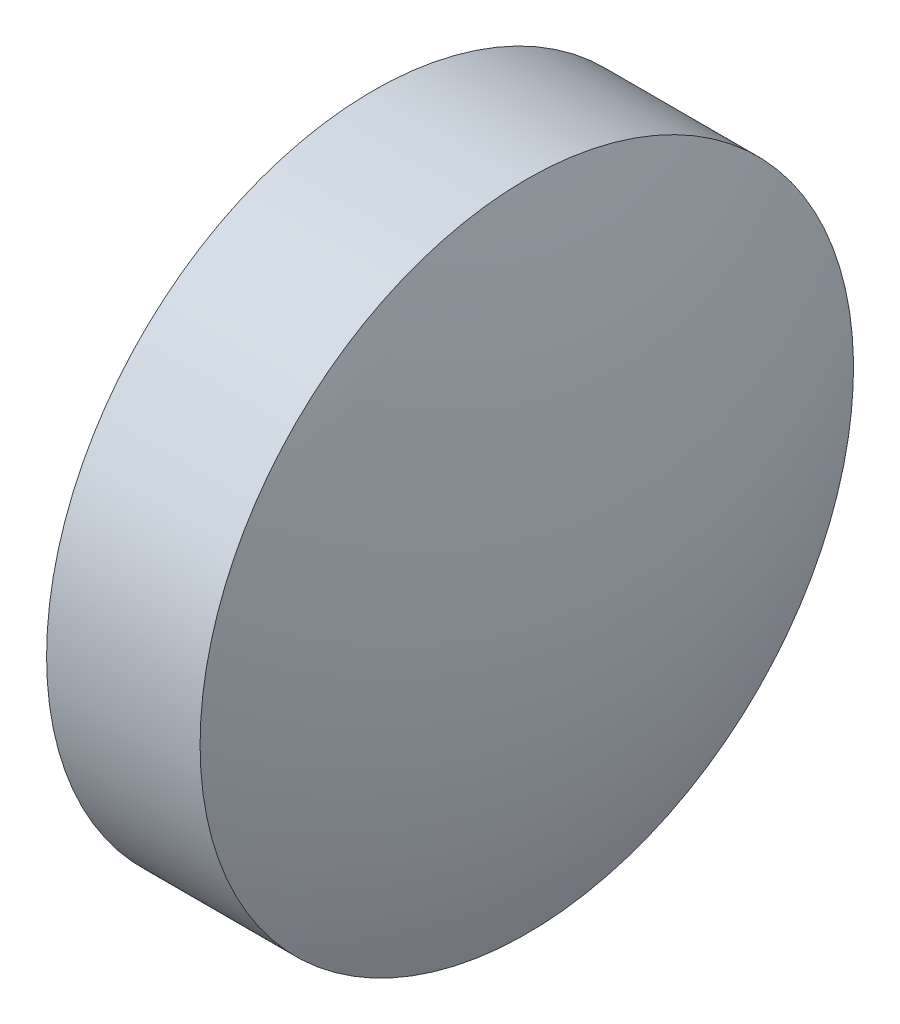
ISO-10303-21;
HEADER;
FILE_DESCRIPTION(('STEP AP214'),'2;1');
FILE_NAME('part.step','',(''),(''),'','','');
FILE_SCHEMA(('AUTOMOTIVE_DESIGN { 1 0 10303 214 1 1 1 1 }'));
ENDSEC;
DATA;
#1=APPLICATION_CONTEXT('core data for automotive mechanical design processes');
#2=APPLICATION_PROTOCOL_DEFINITION('international standard','automotive_design',2000,#1);
#3=PRODUCT_CONTEXT('',#1,'mechanical');
#4=PRODUCT('Part','Part','',(#3));
#5=PRODUCT_RELATED_PRODUCT_CATEGORY('part','',(#4));
#6=PRODUCT_DEFINITION_FORMATION('','',#4);
#7=PRODUCT_DEFINITION_CONTEXT('part definition',#1,'design');
#8=PRODUCT_DEFINITION('design','',#6,#7);
#9=PRODUCT_DEFINITION_SHAPE('','',#8);
#10=(LENGTH_UNIT() NAMED_UNIT(*) SI_UNIT(.MILLI.,.METRE.));
#11=(NAMED_UNIT(*) PLANE_ANGLE_UNIT() SI_UNIT($,.RADIAN.));
#12=(NAMED_UNIT(*) SI_UNIT($,.STERADIAN.) SOLID_ANGLE_UNIT());
#13=UNCERTAINTY_MEASURE_WITH_UNIT(LENGTH_MEASURE(1.E-05),#10,'distance_accuracy_value','');
#14=(GEOMETRIC_REPRESENTATION_CONTEXT(3) GLOBAL_UNCERTAINTY_ASSIGNED_CONTEXT((#13)) GLOBAL_UNIT_ASSIGNED_CONTEXT((#10,
#11,#12)) REPRESENTATION_CONTEXT('',''));
#15=CARTESIAN_POINT('',(0.,0.,0.));
#16=DIRECTION('',(0.,0.,1.));
#17=DIRECTION('',(1.,0.,0.));
#18=AXIS2_PLACEMENT_3D('',#15,#16,#17);
#19=CARTESIAN_POINT('',(508.904259587121,138.924621117667,0.));
#20=DIRECTION('',(-1.,0.,0.));
#21=DIRECTION('',(0.,1.,0.));
#22=AXIS2_PLACEMENT_3D('',#19,#20,#21);
#23=SPHERICAL_SURFACE('',#22,8.31201612903223);
#24=CARTESIAN_POINT('',(516.596275716153,138.924621117667,0.));
#25=DIRECTION('',(-1.,0.,0.));
#26=DIRECTION('',(0.,0.,1.));
#27=AXIS2_PLACEMENT_3D('',#24,#25,#26);
#28=CIRCLE('',#27,3.14999999999999);
#29=CARTESIAN_POINT('',(516.596275716153,138.924621117667,3.14999999999999));
#30=VERTEX_POINT('',#29);
#31=EDGE_CURVE('E10',#30,#30,#28,.T.);
#32=ORIENTED_EDGE('',*,*,#31,.F.);
#33=EDGE_LOOP('',(#32));
#34=FACE_BOUND('',#33,.T.);
#35=ADVANCED_FACE('F35',(#34),#23,.T.);
#36=CARTESIAN_POINT('',(514.626617732559,138.924621117667,0.));
#37=DIRECTION('',(-1.,0.,0.));
#38=DIRECTION('',(0.,0.,1.));
#39=AXIS2_PLACEMENT_3D('',#36,#37,#38);
#40=CYLINDRICAL_SURFACE('',#39,3.14999999999999);
#41=CARTESIAN_POINT('',(515.116275716153,138.924621117667,0.));
#42=DIRECTION('',(-1.,0.,0.));
#43=DIRECTION('',(0.,0.,1.));
#44=AXIS2_PLACEMENT_3D('',#41,#42,#43);
#45=CIRCLE('',#44,3.14999999999999);
#46=CARTESIAN_POINT('',(515.116275716153,138.924621117667,3.14999999999999));
#47=VERTEX_POINT('',#46);
#48=EDGE_CURVE('E41',#47,#47,#45,.T.);
#49=ORIENTED_EDGE('',*,*,#48,.F.);
#50=EDGE_LOOP('',(#49));
#51=FACE_BOUND('',#50,.T.);
#52=ORIENTED_EDGE('',*,*,#31,.T.);
#53=EDGE_LOOP('',(#52));
#54=FACE_BOUND('',#53,.T.);
#55=ADVANCED_FACE('F49',(#51,#54),#40,.T.);
#56=CARTESIAN_POINT('',(515.116275716153,138.924621117667,0.));
#57=DIRECTION('',(1.,0.,0.));
#58=DIRECTION('',(0.,0.,-1.));
#59=AXIS2_PLACEMENT_3D('',#56,#57,#58);
#60=PLANE('',#59);
#61=ORIENTED_EDGE('',*,*,#48,.T.);
#62=EDGE_LOOP('',(#61));
#63=FACE_BOUND('',#62,.T.);
#64=ADVANCED_FACE('F47',(#63),#60,.F.);
#65=CLOSED_SHELL('',(#35,#55,#64));
#66=MANIFOLD_SOLID_BREP('B2',#65);
#67=ADVANCED_BREP_SHAPE_REPRESENTATION('',(#18,#66),#14);
#68=SHAPE_DEFINITION_REPRESENTATION(#9,#67);
ENDSEC;
END-ISO-10303-21;
